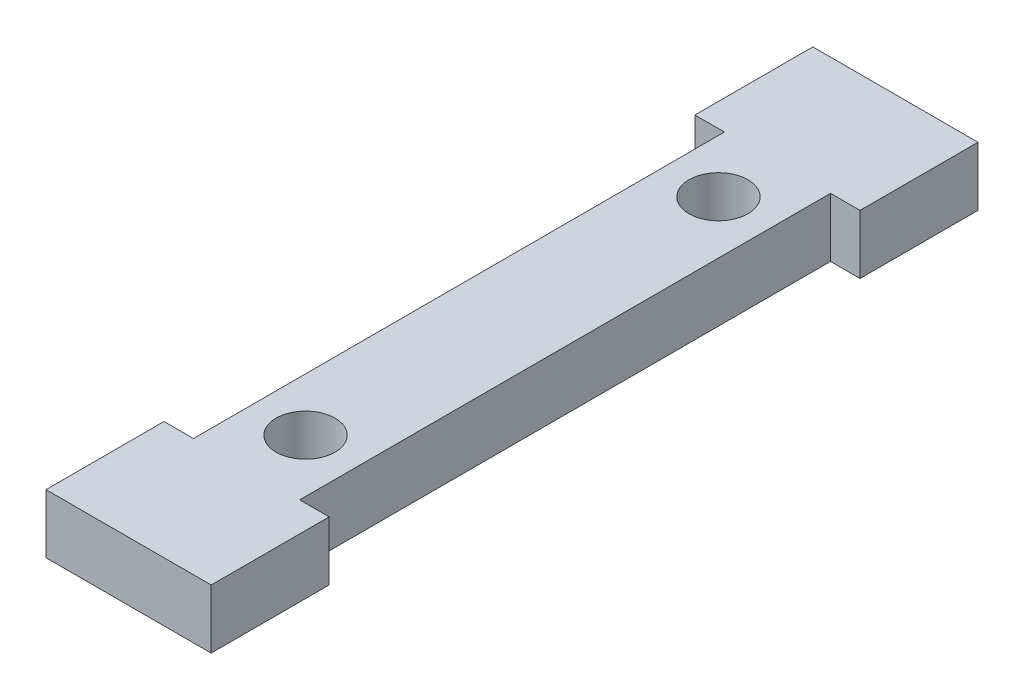
ISO-10303-21;
HEADER;
FILE_DESCRIPTION(('STEP AP214'),'2;1');
FILE_NAME('part.step','',(''),(''),'','','');
FILE_SCHEMA(('AUTOMOTIVE_DESIGN { 1 0 10303 214 1 1 1 1 }'));
ENDSEC;
DATA;
#1=APPLICATION_CONTEXT('core data for automotive mechanical design processes');
#2=APPLICATION_PROTOCOL_DEFINITION('international standard','automotive_design',2000,#1);
#3=PRODUCT_CONTEXT('',#1,'mechanical');
#4=PRODUCT('Part','Part','',(#3));
#5=PRODUCT_RELATED_PRODUCT_CATEGORY('part','',(#4));
#6=PRODUCT_DEFINITION_FORMATION('','',#4);
#7=PRODUCT_DEFINITION_CONTEXT('part definition',#1,'design');
#8=PRODUCT_DEFINITION('design','',#6,#7);
#9=PRODUCT_DEFINITION_SHAPE('','',#8);
#10=(LENGTH_UNIT() NAMED_UNIT(*) SI_UNIT(.MILLI.,.METRE.));
#11=(NAMED_UNIT(*) PLANE_ANGLE_UNIT() SI_UNIT($,.RADIAN.));
#12=(NAMED_UNIT(*) SI_UNIT($,.STERADIAN.) SOLID_ANGLE_UNIT());
#13=UNCERTAINTY_MEASURE_WITH_UNIT(LENGTH_MEASURE(1.E-05),#10,'distance_accuracy_value','');
#14=(GEOMETRIC_REPRESENTATION_CONTEXT(3) GLOBAL_UNCERTAINTY_ASSIGNED_CONTEXT((#13)) GLOBAL_UNIT_ASSIGNED_CONTEXT((#10,
#11,#12)) REPRESENTATION_CONTEXT('',''));
#15=CARTESIAN_POINT('',(0.,0.,0.));
#16=DIRECTION('',(0.,0.,1.));
#17=DIRECTION('',(1.,0.,0.));
#18=AXIS2_PLACEMENT_3D('',#15,#16,#17);
#19=CARTESIAN_POINT('',(0.,6.35,0.));
#20=DIRECTION('',(0.,0.,-1.));
#21=DIRECTION('',(-1.,0.,0.));
#22=AXIS2_PLACEMENT_3D('',#19,#20,#21);
#23=PLANE('',#22);
#24=DIRECTION('',(1.,0.,0.));
#25=VECTOR('',#24,1.);
#26=CARTESIAN_POINT('',(0.,0.,0.));
#27=LINE('',#26,#25);
#28=CARTESIAN_POINT('',(-3.17500000000001,0.,0.));
#29=VERTEX_POINT('',#28);
#30=CARTESIAN_POINT('',(14.605,0.,0.));
#31=VERTEX_POINT('',#30);
#32=EDGE_CURVE('E173',#29,#31,#27,.T.);
#33=ORIENTED_EDGE('',*,*,#32,.T.);
#34=DIRECTION('',(0.,-1.,0.));
#35=VECTOR('',#34,1.);
#36=CARTESIAN_POINT('',(14.605,6.35,0.));
#37=LINE('',#36,#35);
#38=CARTESIAN_POINT('',(14.605,6.35,0.));
#39=VERTEX_POINT('',#38);
#40=EDGE_CURVE('E11',#39,#31,#37,.T.);
#41=ORIENTED_EDGE('',*,*,#40,.F.);
#42=DIRECTION('',(1.,0.,0.));
#43=VECTOR('',#42,1.);
#44=CARTESIAN_POINT('',(0.,6.35,0.));
#45=LINE('',#44,#43);
#46=CARTESIAN_POINT('',(-3.17500000000001,6.35,0.));
#47=VERTEX_POINT('',#46);
#48=EDGE_CURVE('E266',#47,#39,#45,.T.);
#49=ORIENTED_EDGE('',*,*,#48,.F.);
#50=DIRECTION('',(0.,-1.,0.));
#51=VECTOR('',#50,1.);
#52=CARTESIAN_POINT('',(-3.17500000000001,6.35,0.));
#53=LINE('',#52,#51);
#54=EDGE_CURVE('E169',#47,#29,#53,.T.);
#55=ORIENTED_EDGE('',*,*,#54,.T.);
#56=EDGE_LOOP('',(#33,#41,#49,#55));
#57=FACE_BOUND('',#56,.T.);
#58=ADVANCED_FACE('F45',(#57),#23,.F.);
#59=CARTESIAN_POINT('',(14.605,6.35,0.));
#60=DIRECTION('',(-1.,0.,0.));
#61=DIRECTION('',(0.,0.,1.));
#62=AXIS2_PLACEMENT_3D('',#59,#60,#61);
#63=PLANE('',#62);
#64=DIRECTION('',(0.,0.,-1.));
#65=VECTOR('',#64,1.);
#66=CARTESIAN_POINT('',(14.605,0.,0.));
#67=LINE('',#66,#65);
#68=CARTESIAN_POINT('',(14.605,0.,-12.7));
#69=VERTEX_POINT('',#68);
#70=EDGE_CURVE('E176',#31,#69,#67,.T.);
#71=ORIENTED_EDGE('',*,*,#70,.T.);
#72=DIRECTION('',(0.,-1.,0.));
#73=VECTOR('',#72,1.);
#74=CARTESIAN_POINT('',(14.605,6.35,-12.7));
#75=LINE('',#74,#73);
#76=CARTESIAN_POINT('',(14.605,6.35,-12.7));
#77=VERTEX_POINT('',#76);
#78=EDGE_CURVE('E54',#77,#69,#75,.T.);
#79=ORIENTED_EDGE('',*,*,#78,.F.);
#80=DIRECTION('',(0.,0.,-1.));
#81=VECTOR('',#80,1.);
#82=CARTESIAN_POINT('',(14.605,6.35,0.));
#83=LINE('',#82,#81);
#84=EDGE_CURVE('E117',#39,#77,#83,.T.);
#85=ORIENTED_EDGE('',*,*,#84,.F.);
#86=ORIENTED_EDGE('',*,*,#40,.T.);
#87=EDGE_LOOP('',(#71,#79,#85,#86));
#88=FACE_BOUND('',#87,.T.);
#89=ADVANCED_FACE('F279',(#88),#63,.F.);
#90=CARTESIAN_POINT('',(0.,6.35,-12.7));
#91=DIRECTION('',(0.,0.,1.));
#92=DIRECTION('',(1.,0.,0.));
#93=AXIS2_PLACEMENT_3D('',#90,#91,#92);
#94=PLANE('',#93);
#95=DIRECTION('',(-1.,0.,0.));
#96=VECTOR('',#95,1.);
#97=CARTESIAN_POINT('',(0.,0.,-12.7));
#98=LINE('',#97,#96);
#99=CARTESIAN_POINT('',(11.43,0.,-12.7));
#100=VERTEX_POINT('',#99);
#101=EDGE_CURVE('E178',#69,#100,#98,.T.);
#102=ORIENTED_EDGE('',*,*,#101,.T.);
#103=DIRECTION('',(0.,-1.,0.));
#104=VECTOR('',#103,1.);
#105=CARTESIAN_POINT('',(11.43,6.35,-12.7));
#106=LINE('',#105,#104);
#107=CARTESIAN_POINT('',(11.43,6.35,-12.7));
#108=VERTEX_POINT('',#107);
#109=EDGE_CURVE('E217',#108,#100,#106,.T.);
#110=ORIENTED_EDGE('',*,*,#109,.F.);
#111=DIRECTION('',(-1.,0.,0.));
#112=VECTOR('',#111,1.);
#113=CARTESIAN_POINT('',(0.,6.35,-12.7));
#114=LINE('',#113,#112);
#115=EDGE_CURVE('E225',#77,#108,#114,.T.);
#116=ORIENTED_EDGE('',*,*,#115,.F.);
#117=ORIENTED_EDGE('',*,*,#78,.T.);
#118=EDGE_LOOP('',(#102,#110,#116,#117));
#119=FACE_BOUND('',#118,.T.);
#120=ADVANCED_FACE('F223',(#119),#94,.F.);
#121=CARTESIAN_POINT('',(11.43,6.35,0.));
#122=DIRECTION('',(-1.,0.,0.));
#123=DIRECTION('',(0.,0.,1.));
#124=AXIS2_PLACEMENT_3D('',#121,#122,#123);
#125=PLANE('',#124);
#126=DIRECTION('',(0.,0.,-1.));
#127=VECTOR('',#126,1.);
#128=CARTESIAN_POINT('',(11.43,0.,0.));
#129=LINE('',#128,#127);
#130=CARTESIAN_POINT('',(11.43,0.,-69.85));
#131=VERTEX_POINT('',#130);
#132=EDGE_CURVE('E180',#100,#131,#129,.T.);
#133=ORIENTED_EDGE('',*,*,#132,.T.);
#134=DIRECTION('',(0.,-1.,0.));
#135=VECTOR('',#134,1.);
#136=CARTESIAN_POINT('',(11.43,6.35,-69.85));
#137=LINE('',#136,#135);
#138=CARTESIAN_POINT('',(11.43,6.35,-69.85));
#139=VERTEX_POINT('',#138);
#140=EDGE_CURVE('E214',#139,#131,#137,.T.);
#141=ORIENTED_EDGE('',*,*,#140,.F.);
#142=DIRECTION('',(0.,0.,-1.));
#143=VECTOR('',#142,1.);
#144=CARTESIAN_POINT('',(11.43,6.35,0.));
#145=LINE('',#144,#143);
#146=EDGE_CURVE('E244',#108,#139,#145,.T.);
#147=ORIENTED_EDGE('',*,*,#146,.F.);
#148=ORIENTED_EDGE('',*,*,#109,.T.);
#149=EDGE_LOOP('',(#133,#141,#147,#148));
#150=FACE_BOUND('',#149,.T.);
#151=ADVANCED_FACE('F235',(#150),#125,.F.);
#152=CARTESIAN_POINT('',(0.,6.35,-69.85));
#153=DIRECTION('',(0.,0.,-1.));
#154=DIRECTION('',(-1.,0.,0.));
#155=AXIS2_PLACEMENT_3D('',#152,#153,#154);
#156=PLANE('',#155);
#157=DIRECTION('',(1.,0.,0.));
#158=VECTOR('',#157,1.);
#159=CARTESIAN_POINT('',(0.,0.,-69.85));
#160=LINE('',#159,#158);
#161=CARTESIAN_POINT('',(14.605,0.,-69.85));
#162=VERTEX_POINT('',#161);
#163=EDGE_CURVE('E182',#131,#162,#160,.T.);
#164=ORIENTED_EDGE('',*,*,#163,.T.);
#165=DIRECTION('',(0.,-1.,0.));
#166=VECTOR('',#165,1.);
#167=CARTESIAN_POINT('',(14.605,6.35,-69.85));
#168=LINE('',#167,#166);
#169=CARTESIAN_POINT('',(14.605,6.35,-69.85));
#170=VERTEX_POINT('',#169);
#171=EDGE_CURVE('E211',#170,#162,#168,.T.);
#172=ORIENTED_EDGE('',*,*,#171,.F.);
#173=DIRECTION('',(1.,0.,0.));
#174=VECTOR('',#173,1.);
#175=CARTESIAN_POINT('',(0.,6.35,-69.85));
#176=LINE('',#175,#174);
#177=EDGE_CURVE('E241',#139,#170,#176,.T.);
#178=ORIENTED_EDGE('',*,*,#177,.F.);
#179=ORIENTED_EDGE('',*,*,#140,.T.);
#180=EDGE_LOOP('',(#164,#172,#178,#179));
#181=FACE_BOUND('',#180,.T.);
#182=ADVANCED_FACE('F239',(#181),#156,.F.);
#183=CARTESIAN_POINT('',(14.605,6.35,0.));
#184=DIRECTION('',(-1.,0.,0.));
#185=DIRECTION('',(0.,0.,1.));
#186=AXIS2_PLACEMENT_3D('',#183,#184,#185);
#187=PLANE('',#186);
#188=DIRECTION('',(0.,0.,-1.));
#189=VECTOR('',#188,1.);
#190=CARTESIAN_POINT('',(14.605,0.,0.));
#191=LINE('',#190,#189);
#192=CARTESIAN_POINT('',(14.605,0.,-82.55));
#193=VERTEX_POINT('',#192);
#194=EDGE_CURVE('E184',#162,#193,#191,.T.);
#195=ORIENTED_EDGE('',*,*,#194,.T.);
#196=DIRECTION('',(0.,-1.,0.));
#197=VECTOR('',#196,1.);
#198=CARTESIAN_POINT('',(14.605,6.35,-82.55));
#199=LINE('',#198,#197);
#200=CARTESIAN_POINT('',(14.605,6.35,-82.55));
#201=VERTEX_POINT('',#200);
#202=EDGE_CURVE('E208',#201,#193,#199,.T.);
#203=ORIENTED_EDGE('',*,*,#202,.F.);
#204=DIRECTION('',(0.,0.,-1.));
#205=VECTOR('',#204,1.);
#206=CARTESIAN_POINT('',(14.605,6.35,0.));
#207=LINE('',#206,#205);
#208=EDGE_CURVE('E243',#170,#201,#207,.T.);
#209=ORIENTED_EDGE('',*,*,#208,.F.);
#210=ORIENTED_EDGE('',*,*,#171,.T.);
#211=EDGE_LOOP('',(#195,#203,#209,#210));
#212=FACE_BOUND('',#211,.T.);
#213=ADVANCED_FACE('F291',(#212),#187,.F.);
#214=CARTESIAN_POINT('',(0.,6.35,-82.55));
#215=DIRECTION('',(0.,0.,1.));
#216=DIRECTION('',(1.,0.,0.));
#217=AXIS2_PLACEMENT_3D('',#214,#215,#216);
#218=PLANE('',#217);
#219=DIRECTION('',(-1.,0.,0.));
#220=VECTOR('',#219,1.);
#221=CARTESIAN_POINT('',(0.,0.,-82.55));
#222=LINE('',#221,#220);
#223=CARTESIAN_POINT('',(-3.17500000000002,0.,-82.55));
#224=VERTEX_POINT('',#223);
#225=EDGE_CURVE('E186',#193,#224,#222,.T.);
#226=ORIENTED_EDGE('',*,*,#225,.T.);
#227=DIRECTION('',(0.,-1.,0.));
#228=VECTOR('',#227,1.);
#229=CARTESIAN_POINT('',(-3.17500000000002,6.35,-82.55));
#230=LINE('',#229,#228);
#231=CARTESIAN_POINT('',(-3.17500000000002,6.35,-82.55));
#232=VERTEX_POINT('',#231);
#233=EDGE_CURVE('E205',#232,#224,#230,.T.);
#234=ORIENTED_EDGE('',*,*,#233,.F.);
#235=DIRECTION('',(-1.,0.,0.));
#236=VECTOR('',#235,1.);
#237=CARTESIAN_POINT('',(0.,6.35,-82.55));
#238=LINE('',#237,#236);
#239=EDGE_CURVE('E246',#201,#232,#238,.T.);
#240=ORIENTED_EDGE('',*,*,#239,.F.);
#241=ORIENTED_EDGE('',*,*,#202,.T.);
#242=EDGE_LOOP('',(#226,#234,#240,#241));
#243=FACE_BOUND('',#242,.T.);
#244=ADVANCED_FACE('F294',(#243),#218,.F.);
#245=CARTESIAN_POINT('',(-3.17500000000002,6.35,0.));
#246=DIRECTION('',(1.,0.,0.));
#247=DIRECTION('',(0.,0.,-1.));
#248=AXIS2_PLACEMENT_3D('',#245,#246,#247);
#249=PLANE('',#248);
#250=DIRECTION('',(0.,0.,1.));
#251=VECTOR('',#250,1.);
#252=CARTESIAN_POINT('',(-3.17500000000002,0.,0.));
#253=LINE('',#252,#251);
#254=CARTESIAN_POINT('',(-3.17500000000002,0.,-69.85));
#255=VERTEX_POINT('',#254);
#256=EDGE_CURVE('E188',#224,#255,#253,.T.);
#257=ORIENTED_EDGE('',*,*,#256,.T.);
#258=DIRECTION('',(0.,-1.,0.));
#259=VECTOR('',#258,1.);
#260=CARTESIAN_POINT('',(-3.17500000000002,6.35,-69.85));
#261=LINE('',#260,#259);
#262=CARTESIAN_POINT('',(-3.17500000000002,6.35,-69.85));
#263=VERTEX_POINT('',#262);
#264=EDGE_CURVE('E202',#263,#255,#261,.T.);
#265=ORIENTED_EDGE('',*,*,#264,.F.);
#266=DIRECTION('',(0.,0.,1.));
#267=VECTOR('',#266,1.);
#268=CARTESIAN_POINT('',(-3.17500000000002,6.35,0.));
#269=LINE('',#268,#267);
#270=EDGE_CURVE('E252',#232,#263,#269,.T.);
#271=ORIENTED_EDGE('',*,*,#270,.F.);
#272=ORIENTED_EDGE('',*,*,#233,.T.);
#273=EDGE_LOOP('',(#257,#265,#271,#272));
#274=FACE_BOUND('',#273,.T.);
#275=ADVANCED_FACE('F258',(#274),#249,.F.);
#276=CARTESIAN_POINT('',(0.,6.35,-69.85));
#277=DIRECTION('',(0.,0.,-1.));
#278=DIRECTION('',(-1.,0.,0.));
#279=AXIS2_PLACEMENT_3D('',#276,#277,#278);
#280=PLANE('',#279);
#281=DIRECTION('',(1.,0.,0.));
#282=VECTOR('',#281,1.);
#283=CARTESIAN_POINT('',(0.,0.,-69.85));
#284=LINE('',#283,#282);
#285=CARTESIAN_POINT('',(0.,0.,-69.85));
#286=VERTEX_POINT('',#285);
#287=EDGE_CURVE('E190',#255,#286,#284,.T.);
#288=ORIENTED_EDGE('',*,*,#287,.T.);
#289=DIRECTION('',(0.,-1.,0.));
#290=VECTOR('',#289,1.);
#291=CARTESIAN_POINT('',(0.,6.35,-69.85));
#292=LINE('',#291,#290);
#293=CARTESIAN_POINT('',(0.,6.35,-69.85));
#294=VERTEX_POINT('',#293);
#295=EDGE_CURVE('E158',#294,#286,#292,.T.);
#296=ORIENTED_EDGE('',*,*,#295,.F.);
#297=DIRECTION('',(1.,0.,0.));
#298=VECTOR('',#297,1.);
#299=CARTESIAN_POINT('',(0.,6.35,-69.85));
#300=LINE('',#299,#298);
#301=EDGE_CURVE('E149',#263,#294,#300,.T.);
#302=ORIENTED_EDGE('',*,*,#301,.F.);
#303=ORIENTED_EDGE('',*,*,#264,.T.);
#304=EDGE_LOOP('',(#288,#296,#302,#303));
#305=FACE_BOUND('',#304,.T.);
#306=ADVANCED_FACE('F262',(#305),#280,.F.);
#307=CARTESIAN_POINT('',(0.,6.35,0.));
#308=DIRECTION('',(1.,0.,0.));
#309=DIRECTION('',(0.,0.,-1.));
#310=AXIS2_PLACEMENT_3D('',#307,#308,#309);
#311=PLANE('',#310);
#312=DIRECTION('',(0.,0.,1.));
#313=VECTOR('',#312,1.);
#314=CARTESIAN_POINT('',(0.,0.,0.));
#315=LINE('',#314,#313);
#316=CARTESIAN_POINT('',(0.,0.,-12.7));
#317=VERTEX_POINT('',#316);
#318=EDGE_CURVE('E157',#286,#317,#315,.T.);
#319=ORIENTED_EDGE('',*,*,#318,.T.);
#320=DIRECTION('',(0.,-1.,0.));
#321=VECTOR('',#320,1.);
#322=CARTESIAN_POINT('',(0.,6.35,-12.7));
#323=LINE('',#322,#321);
#324=CARTESIAN_POINT('',(0.,6.35,-12.7));
#325=VERTEX_POINT('',#324);
#326=EDGE_CURVE('E154',#325,#317,#323,.T.);
#327=ORIENTED_EDGE('',*,*,#326,.F.);
#328=DIRECTION('',(0.,0.,1.));
#329=VECTOR('',#328,1.);
#330=CARTESIAN_POINT('',(0.,6.35,0.));
#331=LINE('',#330,#329);
#332=EDGE_CURVE('E142',#294,#325,#331,.T.);
#333=ORIENTED_EDGE('',*,*,#332,.F.);
#334=ORIENTED_EDGE('',*,*,#295,.T.);
#335=EDGE_LOOP('',(#319,#327,#333,#334));
#336=FACE_BOUND('',#335,.T.);
#337=ADVANCED_FACE('F155',(#336),#311,.F.);
#338=CARTESIAN_POINT('',(0.,6.35,-12.7));
#339=DIRECTION('',(0.,0.,1.));
#340=DIRECTION('',(1.,0.,0.));
#341=AXIS2_PLACEMENT_3D('',#338,#339,#340);
#342=PLANE('',#341);
#343=DIRECTION('',(-1.,0.,0.));
#344=VECTOR('',#343,1.);
#345=CARTESIAN_POINT('',(0.,0.,-12.7));
#346=LINE('',#345,#344);
#347=CARTESIAN_POINT('',(-3.17500000000001,0.,-12.7));
#348=VERTEX_POINT('',#347);
#349=EDGE_CURVE('E103',#317,#348,#346,.T.);
#350=ORIENTED_EDGE('',*,*,#349,.T.);
#351=DIRECTION('',(0.,-1.,0.));
#352=VECTOR('',#351,1.);
#353=CARTESIAN_POINT('',(-3.17500000000001,6.35,-12.7));
#354=LINE('',#353,#352);
#355=CARTESIAN_POINT('',(-3.17500000000001,6.35,-12.7));
#356=VERTEX_POINT('',#355);
#357=EDGE_CURVE('E159',#356,#348,#354,.T.);
#358=ORIENTED_EDGE('',*,*,#357,.F.);
#359=DIRECTION('',(-1.,0.,0.));
#360=VECTOR('',#359,1.);
#361=CARTESIAN_POINT('',(0.,6.35,-12.7));
#362=LINE('',#361,#360);
#363=EDGE_CURVE('E147',#325,#356,#362,.T.);
#364=ORIENTED_EDGE('',*,*,#363,.F.);
#365=ORIENTED_EDGE('',*,*,#326,.T.);
#366=EDGE_LOOP('',(#350,#358,#364,#365));
#367=FACE_BOUND('',#366,.T.);
#368=ADVANCED_FACE('F161',(#367),#342,.F.);
#369=CARTESIAN_POINT('',(-3.17500000000001,6.35,0.));
#370=DIRECTION('',(1.,0.,0.));
#371=DIRECTION('',(0.,0.,-1.));
#372=AXIS2_PLACEMENT_3D('',#369,#370,#371);
#373=PLANE('',#372);
#374=DIRECTION('',(0.,0.,1.));
#375=VECTOR('',#374,1.);
#376=CARTESIAN_POINT('',(-3.17500000000001,0.,0.));
#377=LINE('',#376,#375);
#378=EDGE_CURVE('E109',#348,#29,#377,.T.);
#379=ORIENTED_EDGE('',*,*,#378,.T.);
#380=ORIENTED_EDGE('',*,*,#54,.F.);
#381=DIRECTION('',(0.,0.,1.));
#382=VECTOR('',#381,1.);
#383=CARTESIAN_POINT('',(-3.17500000000001,6.35,0.));
#384=LINE('',#383,#382);
#385=EDGE_CURVE('E62',#356,#47,#384,.T.);
#386=ORIENTED_EDGE('',*,*,#385,.F.);
#387=ORIENTED_EDGE('',*,*,#357,.T.);
#388=EDGE_LOOP('',(#379,#380,#386,#387));
#389=FACE_BOUND('',#388,.T.);
#390=ADVANCED_FACE('F267',(#389),#373,.F.);
#391=CARTESIAN_POINT('',(5.715,6.35,-63.5));
#392=DIRECTION('',(0.,-1.,0.));
#393=DIRECTION('',(0.,0.,-1.));
#394=AXIS2_PLACEMENT_3D('',#391,#392,#393);
#395=CYLINDRICAL_SURFACE('',#394,3.175);
#396=CARTESIAN_POINT('',(5.715,6.35,-63.5));
#397=DIRECTION('',(0.,1.,0.));
#398=DIRECTION('',(0.,0.,1.));
#399=AXIS2_PLACEMENT_3D('',#396,#397,#398);
#400=CIRCLE('',#399,3.175);
#401=CARTESIAN_POINT('',(5.715,6.35,-60.325));
#402=VERTEX_POINT('',#401);
#403=EDGE_CURVE('E198',#402,#402,#400,.T.);
#404=ORIENTED_EDGE('',*,*,#403,.T.);
#405=EDGE_LOOP('',(#404));
#406=FACE_BOUND('',#405,.T.);
#407=CARTESIAN_POINT('',(5.715,0.,-63.5));
#408=DIRECTION('',(0.,1.,0.));
#409=DIRECTION('',(0.,0.,1.));
#410=AXIS2_PLACEMENT_3D('',#407,#408,#409);
#411=CIRCLE('',#410,3.175);
#412=CARTESIAN_POINT('',(5.715,0.,-60.325));
#413=VERTEX_POINT('',#412);
#414=EDGE_CURVE('E170',#413,#413,#411,.T.);
#415=ORIENTED_EDGE('',*,*,#414,.F.);
#416=EDGE_LOOP('',(#415));
#417=FACE_BOUND('',#416,.T.);
#418=ADVANCED_FACE('F47',(#406,#417),#395,.F.);
#419=CARTESIAN_POINT('',(5.715,6.35,-19.05));
#420=DIRECTION('',(0.,-1.,0.));
#421=DIRECTION('',(0.,0.,-1.));
#422=AXIS2_PLACEMENT_3D('',#419,#420,#421);
#423=CYLINDRICAL_SURFACE('',#422,3.175);
#424=CARTESIAN_POINT('',(5.715,6.35,-19.05));
#425=DIRECTION('',(0.,1.,0.));
#426=DIRECTION('',(0.,0.,1.));
#427=AXIS2_PLACEMENT_3D('',#424,#425,#426);
#428=CIRCLE('',#427,3.175);
#429=CARTESIAN_POINT('',(5.715,6.35,-15.875));
#430=VERTEX_POINT('',#429);
#431=EDGE_CURVE('E163',#430,#430,#428,.T.);
#432=ORIENTED_EDGE('',*,*,#431,.T.);
#433=EDGE_LOOP('',(#432));
#434=FACE_BOUND('',#433,.T.);
#435=CARTESIAN_POINT('',(5.715,0.,-19.05));
#436=DIRECTION('',(0.,1.,0.));
#437=DIRECTION('',(0.,0.,1.));
#438=AXIS2_PLACEMENT_3D('',#435,#436,#437);
#439=CIRCLE('',#438,3.175);
#440=CARTESIAN_POINT('',(5.715,0.,-15.875));
#441=VERTEX_POINT('',#440);
#442=EDGE_CURVE('E195',#441,#441,#439,.T.);
#443=ORIENTED_EDGE('',*,*,#442,.F.);
#444=EDGE_LOOP('',(#443));
#445=FACE_BOUND('',#444,.T.);
#446=ADVANCED_FACE('F274',(#434,#445),#423,.F.);
#447=CARTESIAN_POINT('',(0.,6.35,0.));
#448=DIRECTION('',(0.,1.,0.));
#449=DIRECTION('',(0.,0.,1.));
#450=AXIS2_PLACEMENT_3D('',#447,#448,#449);
#451=PLANE('',#450);
#452=ORIENTED_EDGE('',*,*,#403,.F.);
#453=EDGE_LOOP('',(#452));
#454=FACE_BOUND('',#453,.T.);
#455=ORIENTED_EDGE('',*,*,#48,.T.);
#456=ORIENTED_EDGE('',*,*,#84,.T.);
#457=ORIENTED_EDGE('',*,*,#115,.T.);
#458=ORIENTED_EDGE('',*,*,#146,.T.);
#459=ORIENTED_EDGE('',*,*,#177,.T.);
#460=ORIENTED_EDGE('',*,*,#208,.T.);
#461=ORIENTED_EDGE('',*,*,#239,.T.);
#462=ORIENTED_EDGE('',*,*,#270,.T.);
#463=ORIENTED_EDGE('',*,*,#301,.T.);
#464=ORIENTED_EDGE('',*,*,#332,.T.);
#465=ORIENTED_EDGE('',*,*,#363,.T.);
#466=ORIENTED_EDGE('',*,*,#385,.T.);
#467=EDGE_LOOP('',(#455,#456,#457,#458,#459,#460,#461,#462,#463,#464,#465,#466));
#468=FACE_BOUND('',#467,.T.);
#469=ORIENTED_EDGE('',*,*,#431,.F.);
#470=EDGE_LOOP('',(#469));
#471=FACE_BOUND('',#470,.T.);
#472=ADVANCED_FACE('F144',(#454,#468,#471),#451,.T.);
#473=CARTESIAN_POINT('',(0.,0.,0.));
#474=DIRECTION('',(0.,1.,0.));
#475=DIRECTION('',(0.,0.,1.));
#476=AXIS2_PLACEMENT_3D('',#473,#474,#475);
#477=PLANE('',#476);
#478=ORIENTED_EDGE('',*,*,#414,.T.);
#479=EDGE_LOOP('',(#478));
#480=FACE_BOUND('',#479,.T.);
#481=ORIENTED_EDGE('',*,*,#32,.F.);
#482=ORIENTED_EDGE('',*,*,#378,.F.);
#483=ORIENTED_EDGE('',*,*,#349,.F.);
#484=ORIENTED_EDGE('',*,*,#318,.F.);
#485=ORIENTED_EDGE('',*,*,#287,.F.);
#486=ORIENTED_EDGE('',*,*,#256,.F.);
#487=ORIENTED_EDGE('',*,*,#225,.F.);
#488=ORIENTED_EDGE('',*,*,#194,.F.);
#489=ORIENTED_EDGE('',*,*,#163,.F.);
#490=ORIENTED_EDGE('',*,*,#132,.F.);
#491=ORIENTED_EDGE('',*,*,#101,.F.);
#492=ORIENTED_EDGE('',*,*,#70,.F.);
#493=EDGE_LOOP('',(#481,#482,#483,#484,#485,#486,#487,#488,#489,#490,#491,#492));
#494=FACE_BOUND('',#493,.T.);
#495=ORIENTED_EDGE('',*,*,#442,.T.);
#496=EDGE_LOOP('',(#495));
#497=FACE_BOUND('',#496,.T.);
#498=ADVANCED_FACE('F229',(#480,#494,#497),#477,.F.);
#499=CLOSED_SHELL('',(#58,#89,#120,#151,#182,#213,#244,#275,#306,#337,#368,#390,#418,#446,#472,#498));
#500=MANIFOLD_SOLID_BREP('B2',#499);
#501=ADVANCED_BREP_SHAPE_REPRESENTATION('',(#18,#500),#14);
#502=SHAPE_DEFINITION_REPRESENTATION(#9,#501);
ENDSEC;
END-ISO-10303-21;
